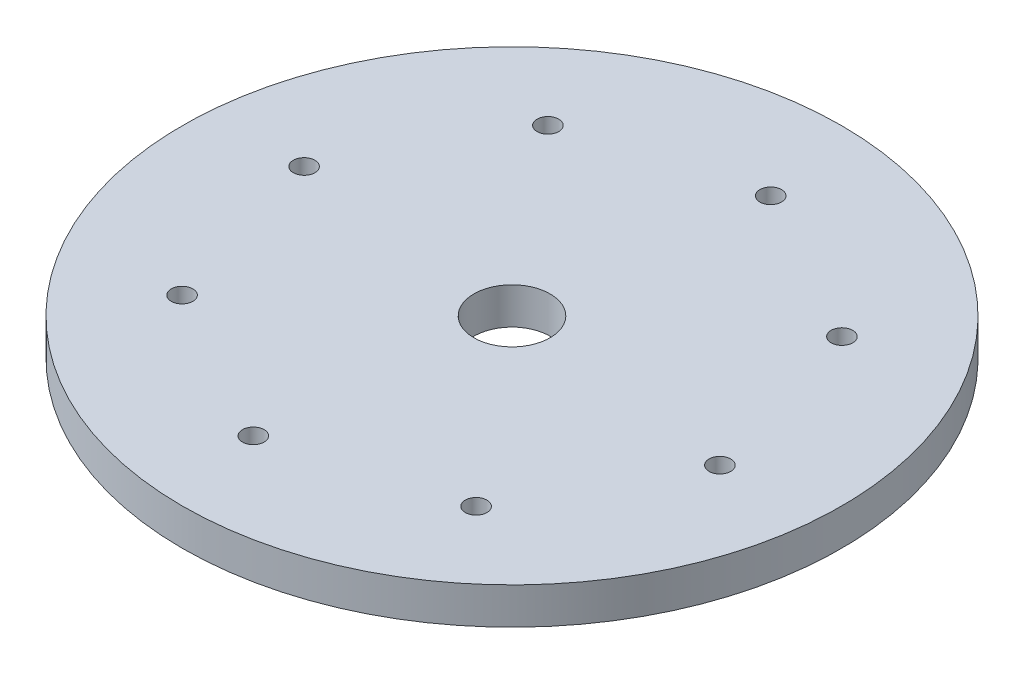
ISO-10303-21;
HEADER;
FILE_DESCRIPTION(('STEP AP214'),'2;1');
FILE_NAME('part.step','',(''),(''),'','','');
FILE_SCHEMA(('AUTOMOTIVE_DESIGN { 1 0 10303 214 1 1 1 1 }'));
ENDSEC;
DATA;
#1=APPLICATION_CONTEXT('core data for automotive mechanical design processes');
#2=APPLICATION_PROTOCOL_DEFINITION('international standard','automotive_design',2000,#1);
#3=PRODUCT_CONTEXT('',#1,'mechanical');
#4=PRODUCT('Part','Part','',(#3));
#5=PRODUCT_RELATED_PRODUCT_CATEGORY('part','',(#4));
#6=PRODUCT_DEFINITION_FORMATION('','',#4);
#7=PRODUCT_DEFINITION_CONTEXT('part definition',#1,'design');
#8=PRODUCT_DEFINITION('design','',#6,#7);
#9=PRODUCT_DEFINITION_SHAPE('','',#8);
#10=(LENGTH_UNIT() NAMED_UNIT(*) SI_UNIT(.MILLI.,.METRE.));
#11=(NAMED_UNIT(*) PLANE_ANGLE_UNIT() SI_UNIT($,.RADIAN.));
#12=(NAMED_UNIT(*) SI_UNIT($,.STERADIAN.) SOLID_ANGLE_UNIT());
#13=UNCERTAINTY_MEASURE_WITH_UNIT(LENGTH_MEASURE(1.E-05),#10,'distance_accuracy_value','');
#14=(GEOMETRIC_REPRESENTATION_CONTEXT(3) GLOBAL_UNCERTAINTY_ASSIGNED_CONTEXT((#13)) GLOBAL_UNIT_ASSIGNED_CONTEXT((#10,
#11,#12)) REPRESENTATION_CONTEXT('',''));
#15=CARTESIAN_POINT('',(0.,0.,0.));
#16=DIRECTION('',(0.,0.,1.));
#17=DIRECTION('',(1.,0.,0.));
#18=AXIS2_PLACEMENT_3D('',#15,#16,#17);
#19=CARTESIAN_POINT('',(0.,5.9563,0.));
#20=DIRECTION('',(0.,1.,0.));
#21=DIRECTION('',(0.,0.,1.));
#22=AXIS2_PLACEMENT_3D('',#19,#20,#21);
#23=PLANE('',#22);
#24=CARTESIAN_POINT('',(4.12531917537974,5.9563,-37.90315));
#25=DIRECTION('',(0.,1.,0.));
#26=DIRECTION('',(0.,0.,1.));
#27=AXIS2_PLACEMENT_3D('',#24,#25,#26);
#28=CIRCLE('',#27,1.75895);
#29=CARTESIAN_POINT('',(4.12531917537974,5.9563,-36.1442));
#30=VERTEX_POINT('',#29);
#31=EDGE_CURVE('E86',#30,#30,#28,.T.);
#32=ORIENTED_EDGE('',*,*,#31,.F.);
#33=EDGE_LOOP('',(#32));
#34=FACE_BOUND('',#33,.T.);
#35=CARTESIAN_POINT('',(-37.90315,5.9563,-4.12531917537974));
#36=DIRECTION('',(0.,1.,0.));
#37=DIRECTION('',(0.,0.,1.));
#38=AXIS2_PLACEMENT_3D('',#35,#36,#37);
#39=CIRCLE('',#38,1.75895);
#40=CARTESIAN_POINT('',(-37.90315,5.9563,-2.36636917537974));
#41=VERTEX_POINT('',#40);
#42=EDGE_CURVE('E74',#41,#41,#39,.T.);
#43=ORIENTED_EDGE('',*,*,#42,.F.);
#44=EDGE_LOOP('',(#43));
#45=FACE_BOUND('',#44,.T.);
#46=CARTESIAN_POINT('',(-4.12531917537975,5.9563,37.90315));
#47=DIRECTION('',(0.,1.,0.));
#48=DIRECTION('',(0.,0.,1.));
#49=AXIS2_PLACEMENT_3D('',#46,#47,#48);
#50=CIRCLE('',#49,1.75895);
#51=CARTESIAN_POINT('',(-4.12531917537975,5.9563,39.6621));
#52=VERTEX_POINT('',#51);
#53=EDGE_CURVE('E62',#52,#52,#50,.T.);
#54=ORIENTED_EDGE('',*,*,#53,.F.);
#55=EDGE_LOOP('',(#54));
#56=FACE_BOUND('',#55,.T.);
#57=CARTESIAN_POINT('',(37.90315,5.9563,4.12531917537975));
#58=DIRECTION('',(0.,1.,0.));
#59=DIRECTION('',(0.,0.,1.));
#60=AXIS2_PLACEMENT_3D('',#57,#58,#59);
#61=CIRCLE('',#60,1.75895);
#62=CARTESIAN_POINT('',(37.90315,5.9563,5.88426917537975));
#63=VERTEX_POINT('',#62);
#64=EDGE_CURVE('E50',#63,#63,#61,.T.);
#65=ORIENTED_EDGE('',*,*,#64,.F.);
#66=EDGE_LOOP('',(#65));
#67=FACE_BOUND('',#66,.T.);
#68=CARTESIAN_POINT('',(0.,5.9563,0.));
#69=DIRECTION('',(0.,1.,0.));
#70=DIRECTION('',(0.,0.,1.));
#71=AXIS2_PLACEMENT_3D('',#68,#69,#70);
#72=CIRCLE('',#71,53.5432);
#73=CARTESIAN_POINT('',(0.,5.9563,53.5432));
#74=VERTEX_POINT('',#73);
#75=EDGE_CURVE('E10',#74,#74,#72,.T.);
#76=ORIENTED_EDGE('',*,*,#75,.T.);
#77=EDGE_LOOP('',(#76));
#78=FACE_BOUND('',#77,.T.);
#79=CARTESIAN_POINT('',(0.,5.9563,0.));
#80=DIRECTION('',(0.,1.,0.));
#81=DIRECTION('',(0.,0.,1.));
#82=AXIS2_PLACEMENT_3D('',#79,#80,#81);
#83=CIRCLE('',#82,6.1849);
#84=CARTESIAN_POINT('',(0.,5.9563,6.1849));
#85=VERTEX_POINT('',#84);
#86=EDGE_CURVE('E45',#85,#85,#83,.T.);
#87=ORIENTED_EDGE('',*,*,#86,.F.);
#88=EDGE_LOOP('',(#87));
#89=FACE_BOUND('',#88,.T.);
#90=CARTESIAN_POINT('',(23.884533229861,5.9563,29.7186155568008));
#91=DIRECTION('',(0.,1.,0.));
#92=DIRECTION('',(0.,0.,1.));
#93=AXIS2_PLACEMENT_3D('',#90,#91,#92);
#94=CIRCLE('',#93,1.75895);
#95=CARTESIAN_POINT('',(23.884533229861,5.9563,31.4775655568008));
#96=VERTEX_POINT('',#95);
#97=EDGE_CURVE('E56',#96,#96,#94,.T.);
#98=ORIENTED_EDGE('',*,*,#97,.F.);
#99=EDGE_LOOP('',(#98));
#100=FACE_BOUND('',#99,.T.);
#101=CARTESIAN_POINT('',(-29.7186155568008,5.9563,23.884533229861));
#102=DIRECTION('',(0.,1.,0.));
#103=DIRECTION('',(0.,0.,1.));
#104=AXIS2_PLACEMENT_3D('',#101,#102,#103);
#105=CIRCLE('',#104,1.75895);
#106=CARTESIAN_POINT('',(-29.7186155568008,5.9563,25.643483229861));
#107=VERTEX_POINT('',#106);
#108=EDGE_CURVE('E68',#107,#107,#105,.T.);
#109=ORIENTED_EDGE('',*,*,#108,.F.);
#110=EDGE_LOOP('',(#109));
#111=FACE_BOUND('',#110,.T.);
#112=CARTESIAN_POINT('',(-23.884533229861,5.9563,-29.7186155568008));
#113=DIRECTION('',(0.,1.,0.));
#114=DIRECTION('',(0.,0.,1.));
#115=AXIS2_PLACEMENT_3D('',#112,#113,#114);
#116=CIRCLE('',#115,1.75895);
#117=CARTESIAN_POINT('',(-23.884533229861,5.9563,-27.9596655568008));
#118=VERTEX_POINT('',#117);
#119=EDGE_CURVE('E80',#118,#118,#116,.T.);
#120=ORIENTED_EDGE('',*,*,#119,.F.);
#121=EDGE_LOOP('',(#120));
#122=FACE_BOUND('',#121,.T.);
#123=CARTESIAN_POINT('',(29.7186155568008,5.9563,-23.884533229861));
#124=DIRECTION('',(0.,1.,0.));
#125=DIRECTION('',(0.,0.,1.));
#126=AXIS2_PLACEMENT_3D('',#123,#124,#125);
#127=CIRCLE('',#126,1.75895);
#128=CARTESIAN_POINT('',(29.7186155568008,5.9563,-22.125583229861));
#129=VERTEX_POINT('',#128);
#130=EDGE_CURVE('E92',#129,#129,#127,.T.);
#131=ORIENTED_EDGE('',*,*,#130,.F.);
#132=EDGE_LOOP('',(#131));
#133=FACE_BOUND('',#132,.T.);
#134=ADVANCED_FACE('F34',(#34,#45,#56,#67,#78,#89,#100,#111,#122,#133),#23,.T.);
#135=CARTESIAN_POINT('',(0.,0.,0.));
#136=DIRECTION('',(0.,1.,0.));
#137=DIRECTION('',(0.,0.,1.));
#138=AXIS2_PLACEMENT_3D('',#135,#136,#137);
#139=PLANE('',#138);
#140=CARTESIAN_POINT('',(0.,0.,0.));
#141=DIRECTION('',(0.,1.,0.));
#142=DIRECTION('',(0.,0.,1.));
#143=AXIS2_PLACEMENT_3D('',#140,#141,#142);
#144=CIRCLE('',#143,53.5432);
#145=CARTESIAN_POINT('',(0.,0.,53.5432));
#146=VERTEX_POINT('',#145);
#147=EDGE_CURVE('E38',#146,#146,#144,.T.);
#148=ORIENTED_EDGE('',*,*,#147,.F.);
#149=EDGE_LOOP('',(#148));
#150=FACE_BOUND('',#149,.T.);
#151=CARTESIAN_POINT('',(0.,0.,0.));
#152=DIRECTION('',(0.,1.,0.));
#153=DIRECTION('',(0.,0.,1.));
#154=AXIS2_PLACEMENT_3D('',#151,#152,#153);
#155=CIRCLE('',#154,6.1849);
#156=CARTESIAN_POINT('',(0.,0.,6.1849));
#157=VERTEX_POINT('',#156);
#158=EDGE_CURVE('E47',#157,#157,#155,.T.);
#159=ORIENTED_EDGE('',*,*,#158,.T.);
#160=EDGE_LOOP('',(#159));
#161=FACE_BOUND('',#160,.T.);
#162=CARTESIAN_POINT('',(37.90315,0.,4.12531917537975));
#163=DIRECTION('',(0.,1.,0.));
#164=DIRECTION('',(0.,0.,1.));
#165=AXIS2_PLACEMENT_3D('',#162,#163,#164);
#166=CIRCLE('',#165,1.75895);
#167=CARTESIAN_POINT('',(37.90315,0.,5.88426917537975));
#168=VERTEX_POINT('',#167);
#169=EDGE_CURVE('E53',#168,#168,#166,.T.);
#170=ORIENTED_EDGE('',*,*,#169,.T.);
#171=EDGE_LOOP('',(#170));
#172=FACE_BOUND('',#171,.T.);
#173=CARTESIAN_POINT('',(23.884533229861,0.,29.7186155568008));
#174=DIRECTION('',(0.,1.,0.));
#175=DIRECTION('',(0.,0.,1.));
#176=AXIS2_PLACEMENT_3D('',#173,#174,#175);
#177=CIRCLE('',#176,1.75895);
#178=CARTESIAN_POINT('',(23.884533229861,0.,31.4775655568008));
#179=VERTEX_POINT('',#178);
#180=EDGE_CURVE('E59',#179,#179,#177,.T.);
#181=ORIENTED_EDGE('',*,*,#180,.T.);
#182=EDGE_LOOP('',(#181));
#183=FACE_BOUND('',#182,.T.);
#184=CARTESIAN_POINT('',(-4.12531917537975,0.,37.90315));
#185=DIRECTION('',(0.,1.,0.));
#186=DIRECTION('',(0.,0.,1.));
#187=AXIS2_PLACEMENT_3D('',#184,#185,#186);
#188=CIRCLE('',#187,1.75895);
#189=CARTESIAN_POINT('',(-4.12531917537975,0.,39.6621));
#190=VERTEX_POINT('',#189);
#191=EDGE_CURVE('E65',#190,#190,#188,.T.);
#192=ORIENTED_EDGE('',*,*,#191,.T.);
#193=EDGE_LOOP('',(#192));
#194=FACE_BOUND('',#193,.T.);
#195=CARTESIAN_POINT('',(-29.7186155568008,0.,23.884533229861));
#196=DIRECTION('',(0.,1.,0.));
#197=DIRECTION('',(0.,0.,1.));
#198=AXIS2_PLACEMENT_3D('',#195,#196,#197);
#199=CIRCLE('',#198,1.75895);
#200=CARTESIAN_POINT('',(-29.7186155568008,0.,25.643483229861));
#201=VERTEX_POINT('',#200);
#202=EDGE_CURVE('E71',#201,#201,#199,.T.);
#203=ORIENTED_EDGE('',*,*,#202,.T.);
#204=EDGE_LOOP('',(#203));
#205=FACE_BOUND('',#204,.T.);
#206=CARTESIAN_POINT('',(-37.90315,0.,-4.12531917537974));
#207=DIRECTION('',(0.,1.,0.));
#208=DIRECTION('',(0.,0.,1.));
#209=AXIS2_PLACEMENT_3D('',#206,#207,#208);
#210=CIRCLE('',#209,1.75895);
#211=CARTESIAN_POINT('',(-37.90315,0.,-2.36636917537974));
#212=VERTEX_POINT('',#211);
#213=EDGE_CURVE('E77',#212,#212,#210,.T.);
#214=ORIENTED_EDGE('',*,*,#213,.T.);
#215=EDGE_LOOP('',(#214));
#216=FACE_BOUND('',#215,.T.);
#217=CARTESIAN_POINT('',(-23.884533229861,0.,-29.7186155568008));
#218=DIRECTION('',(0.,1.,0.));
#219=DIRECTION('',(0.,0.,1.));
#220=AXIS2_PLACEMENT_3D('',#217,#218,#219);
#221=CIRCLE('',#220,1.75895);
#222=CARTESIAN_POINT('',(-23.884533229861,0.,-27.9596655568008));
#223=VERTEX_POINT('',#222);
#224=EDGE_CURVE('E83',#223,#223,#221,.T.);
#225=ORIENTED_EDGE('',*,*,#224,.T.);
#226=EDGE_LOOP('',(#225));
#227=FACE_BOUND('',#226,.T.);
#228=CARTESIAN_POINT('',(4.12531917537974,0.,-37.90315));
#229=DIRECTION('',(0.,1.,0.));
#230=DIRECTION('',(0.,0.,1.));
#231=AXIS2_PLACEMENT_3D('',#228,#229,#230);
#232=CIRCLE('',#231,1.75895);
#233=CARTESIAN_POINT('',(4.12531917537974,0.,-36.1442));
#234=VERTEX_POINT('',#233);
#235=EDGE_CURVE('E89',#234,#234,#232,.T.);
#236=ORIENTED_EDGE('',*,*,#235,.T.);
#237=EDGE_LOOP('',(#236));
#238=FACE_BOUND('',#237,.T.);
#239=CARTESIAN_POINT('',(29.7186155568008,0.,-23.884533229861));
#240=DIRECTION('',(0.,1.,0.));
#241=DIRECTION('',(0.,0.,1.));
#242=AXIS2_PLACEMENT_3D('',#239,#240,#241);
#243=CIRCLE('',#242,1.75895);
#244=CARTESIAN_POINT('',(29.7186155568008,0.,-22.125583229861));
#245=VERTEX_POINT('',#244);
#246=EDGE_CURVE('E95',#245,#245,#243,.T.);
#247=ORIENTED_EDGE('',*,*,#246,.T.);
#248=EDGE_LOOP('',(#247));
#249=FACE_BOUND('',#248,.T.);
#250=ADVANCED_FACE('F105',(#150,#161,#172,#183,#194,#205,#216,#227,#238,#249),#139,.F.);
#251=CARTESIAN_POINT('',(0.,5.9563,0.));
#252=DIRECTION('',(0.,-1.,0.));
#253=DIRECTION('',(0.,0.,-1.));
#254=AXIS2_PLACEMENT_3D('',#251,#252,#253);
#255=CYLINDRICAL_SURFACE('',#254,53.5432);
#256=ORIENTED_EDGE('',*,*,#75,.F.);
#257=EDGE_LOOP('',(#256));
#258=FACE_BOUND('',#257,.T.);
#259=ORIENTED_EDGE('',*,*,#147,.T.);
#260=EDGE_LOOP('',(#259));
#261=FACE_BOUND('',#260,.T.);
#262=ADVANCED_FACE('F36',(#258,#261),#255,.T.);
#263=CARTESIAN_POINT('',(0.,5.9563,0.));
#264=DIRECTION('',(0.,-1.,0.));
#265=DIRECTION('',(0.,0.,-1.));
#266=AXIS2_PLACEMENT_3D('',#263,#264,#265);
#267=CYLINDRICAL_SURFACE('',#266,6.1849);
#268=ORIENTED_EDGE('',*,*,#86,.T.);
#269=EDGE_LOOP('',(#268));
#270=FACE_BOUND('',#269,.T.);
#271=ORIENTED_EDGE('',*,*,#158,.F.);
#272=EDGE_LOOP('',(#271));
#273=FACE_BOUND('',#272,.T.);
#274=ADVANCED_FACE('F115',(#270,#273),#267,.F.);
#275=CARTESIAN_POINT('',(37.90315,5.9563,4.12531917537975));
#276=DIRECTION('',(0.,-1.,0.));
#277=DIRECTION('',(0.,0.,-1.));
#278=AXIS2_PLACEMENT_3D('',#275,#276,#277);
#279=CYLINDRICAL_SURFACE('',#278,1.75895);
#280=ORIENTED_EDGE('',*,*,#64,.T.);
#281=EDGE_LOOP('',(#280));
#282=FACE_BOUND('',#281,.T.);
#283=ORIENTED_EDGE('',*,*,#169,.F.);
#284=EDGE_LOOP('',(#283));
#285=FACE_BOUND('',#284,.T.);
#286=ADVANCED_FACE('F118',(#282,#285),#279,.F.);
#287=CARTESIAN_POINT('',(23.884533229861,5.9563,29.7186155568008));
#288=DIRECTION('',(0.,-1.,0.));
#289=DIRECTION('',(0.,0.,-1.));
#290=AXIS2_PLACEMENT_3D('',#287,#288,#289);
#291=CYLINDRICAL_SURFACE('',#290,1.75895);
#292=ORIENTED_EDGE('',*,*,#97,.T.);
#293=EDGE_LOOP('',(#292));
#294=FACE_BOUND('',#293,.T.);
#295=ORIENTED_EDGE('',*,*,#180,.F.);
#296=EDGE_LOOP('',(#295));
#297=FACE_BOUND('',#296,.T.);
#298=ADVANCED_FACE('F122',(#294,#297),#291,.F.);
#299=CARTESIAN_POINT('',(-4.12531917537975,5.9563,37.90315));
#300=DIRECTION('',(0.,-1.,0.));
#301=DIRECTION('',(0.,0.,-1.));
#302=AXIS2_PLACEMENT_3D('',#299,#300,#301);
#303=CYLINDRICAL_SURFACE('',#302,1.75895);
#304=ORIENTED_EDGE('',*,*,#53,.T.);
#305=EDGE_LOOP('',(#304));
#306=FACE_BOUND('',#305,.T.);
#307=ORIENTED_EDGE('',*,*,#191,.F.);
#308=EDGE_LOOP('',(#307));
#309=FACE_BOUND('',#308,.T.);
#310=ADVANCED_FACE('F126',(#306,#309),#303,.F.);
#311=CARTESIAN_POINT('',(-29.7186155568008,5.9563,23.884533229861));
#312=DIRECTION('',(0.,-1.,0.));
#313=DIRECTION('',(0.,0.,-1.));
#314=AXIS2_PLACEMENT_3D('',#311,#312,#313);
#315=CYLINDRICAL_SURFACE('',#314,1.75895);
#316=ORIENTED_EDGE('',*,*,#108,.T.);
#317=EDGE_LOOP('',(#316));
#318=FACE_BOUND('',#317,.T.);
#319=ORIENTED_EDGE('',*,*,#202,.F.);
#320=EDGE_LOOP('',(#319));
#321=FACE_BOUND('',#320,.T.);
#322=ADVANCED_FACE('F130',(#318,#321),#315,.F.);
#323=CARTESIAN_POINT('',(-37.90315,5.9563,-4.12531917537974));
#324=DIRECTION('',(0.,-1.,0.));
#325=DIRECTION('',(0.,0.,-1.));
#326=AXIS2_PLACEMENT_3D('',#323,#324,#325);
#327=CYLINDRICAL_SURFACE('',#326,1.75895);
#328=ORIENTED_EDGE('',*,*,#42,.T.);
#329=EDGE_LOOP('',(#328));
#330=FACE_BOUND('',#329,.T.);
#331=ORIENTED_EDGE('',*,*,#213,.F.);
#332=EDGE_LOOP('',(#331));
#333=FACE_BOUND('',#332,.T.);
#334=ADVANCED_FACE('F134',(#330,#333),#327,.F.);
#335=CARTESIAN_POINT('',(-23.884533229861,5.9563,-29.7186155568008));
#336=DIRECTION('',(0.,-1.,0.));
#337=DIRECTION('',(0.,0.,-1.));
#338=AXIS2_PLACEMENT_3D('',#335,#336,#337);
#339=CYLINDRICAL_SURFACE('',#338,1.75895);
#340=ORIENTED_EDGE('',*,*,#119,.T.);
#341=EDGE_LOOP('',(#340));
#342=FACE_BOUND('',#341,.T.);
#343=ORIENTED_EDGE('',*,*,#224,.F.);
#344=EDGE_LOOP('',(#343));
#345=FACE_BOUND('',#344,.T.);
#346=ADVANCED_FACE('F138',(#342,#345),#339,.F.);
#347=CARTESIAN_POINT('',(4.12531917537974,5.9563,-37.90315));
#348=DIRECTION('',(0.,-1.,0.));
#349=DIRECTION('',(0.,0.,-1.));
#350=AXIS2_PLACEMENT_3D('',#347,#348,#349);
#351=CYLINDRICAL_SURFACE('',#350,1.75895);
#352=ORIENTED_EDGE('',*,*,#31,.T.);
#353=EDGE_LOOP('',(#352));
#354=FACE_BOUND('',#353,.T.);
#355=ORIENTED_EDGE('',*,*,#235,.F.);
#356=EDGE_LOOP('',(#355));
#357=FACE_BOUND('',#356,.T.);
#358=ADVANCED_FACE('F142',(#354,#357),#351,.F.);
#359=CARTESIAN_POINT('',(29.7186155568008,5.9563,-23.884533229861));
#360=DIRECTION('',(0.,-1.,0.));
#361=DIRECTION('',(0.,0.,-1.));
#362=AXIS2_PLACEMENT_3D('',#359,#360,#361);
#363=CYLINDRICAL_SURFACE('',#362,1.75895);
#364=ORIENTED_EDGE('',*,*,#130,.T.);
#365=EDGE_LOOP('',(#364));
#366=FACE_BOUND('',#365,.T.);
#367=ORIENTED_EDGE('',*,*,#246,.F.);
#368=EDGE_LOOP('',(#367));
#369=FACE_BOUND('',#368,.T.);
#370=ADVANCED_FACE('F101',(#366,#369),#363,.F.);
#371=CLOSED_SHELL('',(#134,#250,#262,#274,#286,#298,#310,#322,#334,#346,#358,#370));
#372=MANIFOLD_SOLID_BREP('B2',#371);
#373=ADVANCED_BREP_SHAPE_REPRESENTATION('',(#18,#372),#14);
#374=SHAPE_DEFINITION_REPRESENTATION(#9,#373);
ENDSEC;
END-ISO-10303-21;
